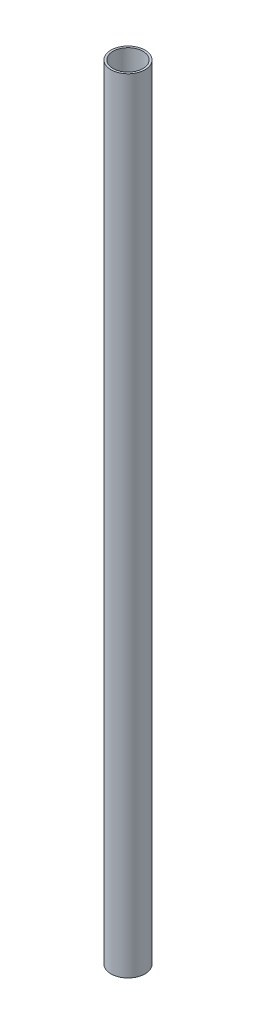
ISO-10303-21;
HEADER;
FILE_DESCRIPTION(('STEP AP214'),'2;1');
FILE_NAME('part.step','',(''),(''),'','','');
FILE_SCHEMA(('AUTOMOTIVE_DESIGN { 1 0 10303 214 1 1 1 1 }'));
ENDSEC;
DATA;
#1=APPLICATION_CONTEXT('core data for automotive mechanical design processes');
#2=APPLICATION_PROTOCOL_DEFINITION('international standard','automotive_design',2000,#1);
#3=PRODUCT_CONTEXT('',#1,'mechanical');
#4=PRODUCT('Part','Part','',(#3));
#5=PRODUCT_RELATED_PRODUCT_CATEGORY('part','',(#4));
#6=PRODUCT_DEFINITION_FORMATION('','',#4);
#7=PRODUCT_DEFINITION_CONTEXT('part definition',#1,'design');
#8=PRODUCT_DEFINITION('design','',#6,#7);
#9=PRODUCT_DEFINITION_SHAPE('','',#8);
#10=(LENGTH_UNIT() NAMED_UNIT(*) SI_UNIT(.MILLI.,.METRE.));
#11=(NAMED_UNIT(*) PLANE_ANGLE_UNIT() SI_UNIT($,.RADIAN.));
#12=(NAMED_UNIT(*) SI_UNIT($,.STERADIAN.) SOLID_ANGLE_UNIT());
#13=UNCERTAINTY_MEASURE_WITH_UNIT(LENGTH_MEASURE(1.E-05),#10,'distance_accuracy_value','');
#14=(GEOMETRIC_REPRESENTATION_CONTEXT(3) GLOBAL_UNCERTAINTY_ASSIGNED_CONTEXT((#13)) GLOBAL_UNIT_ASSIGNED_CONTEXT((#10,
#11,#12)) REPRESENTATION_CONTEXT('',''));
#15=CARTESIAN_POINT('',(0.,0.,0.));
#16=DIRECTION('',(0.,0.,1.));
#17=DIRECTION('',(1.,0.,0.));
#18=AXIS2_PLACEMENT_3D('',#15,#16,#17);
#19=CARTESIAN_POINT('',(0.,584.2,0.));
#20=DIRECTION('',(0.,1.,0.));
#21=DIRECTION('',(0.,0.,1.));
#22=AXIS2_PLACEMENT_3D('',#19,#20,#21);
#23=PLANE('',#22);
#24=CARTESIAN_POINT('',(0.,584.2,0.));
#25=DIRECTION('',(0.,1.,0.));
#26=DIRECTION('',(0.,0.,1.));
#27=AXIS2_PLACEMENT_3D('',#24,#25,#26);
#28=CIRCLE('',#27,12.7);
#29=CARTESIAN_POINT('',(0.,584.2,12.7));
#30=VERTEX_POINT('',#29);
#31=EDGE_CURVE('E10',#30,#30,#28,.T.);
#32=ORIENTED_EDGE('',*,*,#31,.T.);
#33=EDGE_LOOP('',(#32));
#34=FACE_BOUND('',#33,.T.);
#35=CARTESIAN_POINT('',(0.,584.2,0.));
#36=DIRECTION('',(0.,1.,0.));
#37=DIRECTION('',(0.,0.,1.));
#38=AXIS2_PLACEMENT_3D('',#35,#36,#37);
#39=CIRCLE('',#38,11.176);
#40=CARTESIAN_POINT('',(0.,584.2,11.176));
#41=VERTEX_POINT('',#40);
#42=EDGE_CURVE('E42',#41,#41,#39,.T.);
#43=ORIENTED_EDGE('',*,*,#42,.F.);
#44=EDGE_LOOP('',(#43));
#45=FACE_BOUND('',#44,.T.);
#46=ADVANCED_FACE('F31',(#34,#45),#23,.T.);
#47=CARTESIAN_POINT('',(0.,0.,0.));
#48=DIRECTION('',(0.,1.,0.));
#49=DIRECTION('',(0.,0.,1.));
#50=AXIS2_PLACEMENT_3D('',#47,#48,#49);
#51=PLANE('',#50);
#52=CARTESIAN_POINT('',(0.,0.,0.));
#53=DIRECTION('',(0.,1.,0.));
#54=DIRECTION('',(0.,0.,1.));
#55=AXIS2_PLACEMENT_3D('',#52,#53,#54);
#56=CIRCLE('',#55,12.7);
#57=CARTESIAN_POINT('',(0.,0.,12.7));
#58=VERTEX_POINT('',#57);
#59=EDGE_CURVE('E35',#58,#58,#56,.T.);
#60=ORIENTED_EDGE('',*,*,#59,.F.);
#61=EDGE_LOOP('',(#60));
#62=FACE_BOUND('',#61,.T.);
#63=CARTESIAN_POINT('',(0.,0.,0.));
#64=DIRECTION('',(0.,1.,0.));
#65=DIRECTION('',(0.,0.,1.));
#66=AXIS2_PLACEMENT_3D('',#63,#64,#65);
#67=CIRCLE('',#66,11.176);
#68=CARTESIAN_POINT('',(0.,0.,11.176));
#69=VERTEX_POINT('',#68);
#70=EDGE_CURVE('E44',#69,#69,#67,.T.);
#71=ORIENTED_EDGE('',*,*,#70,.T.);
#72=EDGE_LOOP('',(#71));
#73=FACE_BOUND('',#72,.T.);
#74=ADVANCED_FACE('F54',(#62,#73),#51,.F.);
#75=CARTESIAN_POINT('',(0.,584.2,0.));
#76=DIRECTION('',(0.,-1.,0.));
#77=DIRECTION('',(0.,0.,-1.));
#78=AXIS2_PLACEMENT_3D('',#75,#76,#77);
#79=CYLINDRICAL_SURFACE('',#78,12.7);
#80=ORIENTED_EDGE('',*,*,#31,.F.);
#81=EDGE_LOOP('',(#80));
#82=FACE_BOUND('',#81,.T.);
#83=ORIENTED_EDGE('',*,*,#59,.T.);
#84=EDGE_LOOP('',(#83));
#85=FACE_BOUND('',#84,.T.);
#86=ADVANCED_FACE('F33',(#82,#85),#79,.T.);
#87=CARTESIAN_POINT('',(0.,584.2,0.));
#88=DIRECTION('',(0.,-1.,0.));
#89=DIRECTION('',(0.,0.,-1.));
#90=AXIS2_PLACEMENT_3D('',#87,#88,#89);
#91=CYLINDRICAL_SURFACE('',#90,11.176);
#92=ORIENTED_EDGE('',*,*,#42,.T.);
#93=EDGE_LOOP('',(#92));
#94=FACE_BOUND('',#93,.T.);
#95=ORIENTED_EDGE('',*,*,#70,.F.);
#96=EDGE_LOOP('',(#95));
#97=FACE_BOUND('',#96,.T.);
#98=ADVANCED_FACE('F50',(#94,#97),#91,.F.);
#99=CLOSED_SHELL('',(#46,#74,#86,#98));
#100=MANIFOLD_SOLID_BREP('B2',#99);
#101=ADVANCED_BREP_SHAPE_REPRESENTATION('',(#18,#100),#14);
#102=SHAPE_DEFINITION_REPRESENTATION(#9,#101);
ENDSEC;
END-ISO-10303-21;
